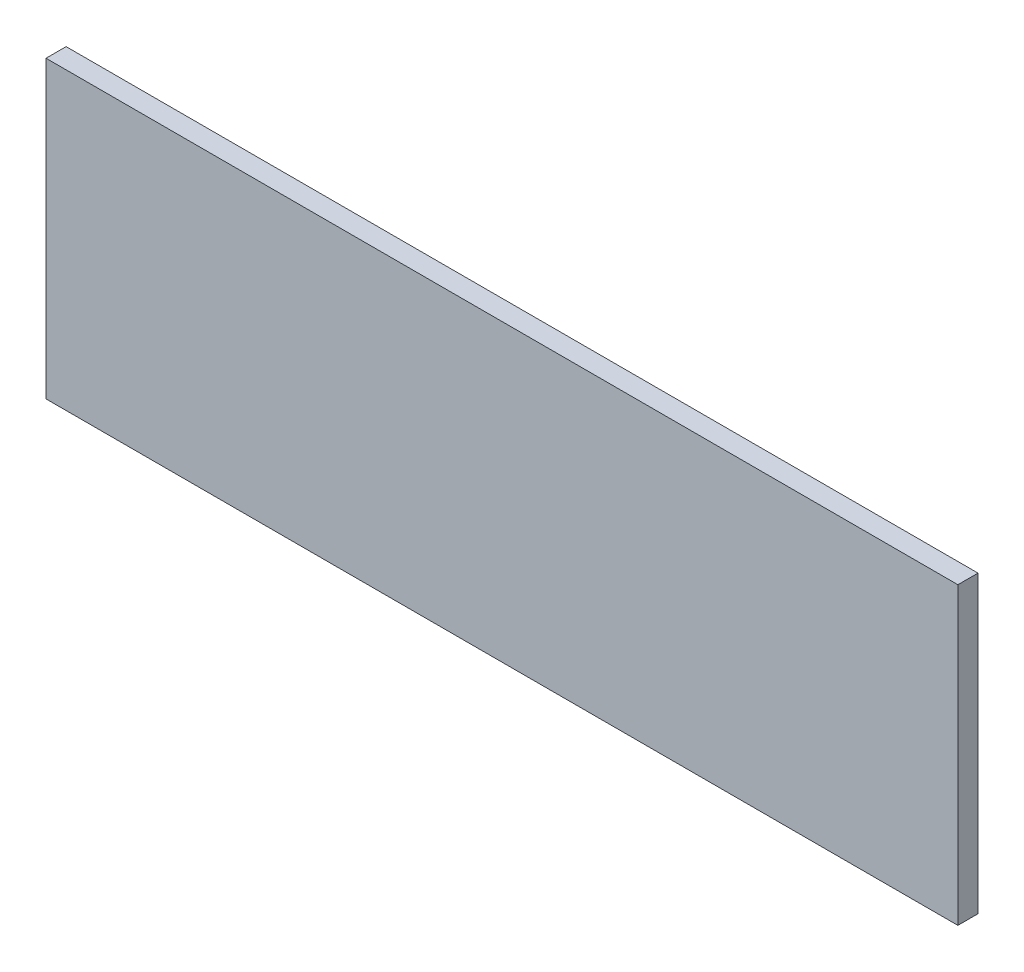
ISO-10303-21;
HEADER;
FILE_DESCRIPTION(('STEP AP214'),'2;1');
FILE_NAME('part.step','',(''),(''),'','','');
FILE_SCHEMA(('AUTOMOTIVE_DESIGN { 1 0 10303 214 1 1 1 1 }'));
ENDSEC;
DATA;
#1=APPLICATION_CONTEXT('core data for automotive mechanical design processes');
#2=APPLICATION_PROTOCOL_DEFINITION('international standard','automotive_design',2000,#1);
#3=PRODUCT_CONTEXT('',#1,'mechanical');
#4=PRODUCT('Part','Part','',(#3));
#5=PRODUCT_RELATED_PRODUCT_CATEGORY('part','',(#4));
#6=PRODUCT_DEFINITION_FORMATION('','',#4);
#7=PRODUCT_DEFINITION_CONTEXT('part definition',#1,'design');
#8=PRODUCT_DEFINITION('design','',#6,#7);
#9=PRODUCT_DEFINITION_SHAPE('','',#8);
#10=(LENGTH_UNIT() NAMED_UNIT(*) SI_UNIT(.MILLI.,.METRE.));
#11=(NAMED_UNIT(*) PLANE_ANGLE_UNIT() SI_UNIT($,.RADIAN.));
#12=(NAMED_UNIT(*) SI_UNIT($,.STERADIAN.) SOLID_ANGLE_UNIT());
#13=UNCERTAINTY_MEASURE_WITH_UNIT(LENGTH_MEASURE(1.E-05),#10,'distance_accuracy_value','');
#14=(GEOMETRIC_REPRESENTATION_CONTEXT(3) GLOBAL_UNCERTAINTY_ASSIGNED_CONTEXT((#13)) GLOBAL_UNIT_ASSIGNED_CONTEXT((#10,
#11,#12)) REPRESENTATION_CONTEXT('',''));
#15=CARTESIAN_POINT('',(0.,0.,0.));
#16=DIRECTION('',(0.,0.,1.));
#17=DIRECTION('',(1.,0.,0.));
#18=AXIS2_PLACEMENT_3D('',#15,#16,#17);
#19=CARTESIAN_POINT('',(52.6371308016878,-0.0100000000000031,-44.8481012658228));
#20=DIRECTION('',(1.,0.,0.));
#21=DIRECTION('',(0.,0.,-1.));
#22=AXIS2_PLACEMENT_3D('',#19,#20,#21);
#23=PLANE('',#22);
#24=DIRECTION('',(0.,0.,1.));
#25=VECTOR('',#24,1.);
#26=CARTESIAN_POINT('',(52.6371308016878,3.,0.));
#27=LINE('',#26,#25);
#28=CARTESIAN_POINT('',(52.6371308016878,3.,-47.8481012658228));
#29=VERTEX_POINT('',#28);
#30=CARTESIAN_POINT('',(52.6371308016878,3.,-44.8481012658228));
#31=VERTEX_POINT('',#30);
#32=EDGE_CURVE('E90',#29,#31,#27,.T.);
#33=ORIENTED_EDGE('',*,*,#32,.F.);
#34=DIRECTION('',(0.,1.,0.));
#35=VECTOR('',#34,1.);
#36=CARTESIAN_POINT('',(52.6371308016878,-0.0100000000000031,-47.8481012658228));
#37=LINE('',#36,#35);
#38=CARTESIAN_POINT('',(52.6371308016878,47.,-47.8481012658228));
#39=VERTEX_POINT('',#38);
#40=EDGE_CURVE('E77',#29,#39,#37,.T.);
#41=ORIENTED_EDGE('',*,*,#40,.T.);
#42=DIRECTION('',(0.,0.,-1.));
#43=VECTOR('',#42,1.);
#44=CARTESIAN_POINT('',(52.6371308016878,47.,0.));
#45=LINE('',#44,#43);
#46=CARTESIAN_POINT('',(52.6371308016878,47.,-44.8481012658228));
#47=VERTEX_POINT('',#46);
#48=EDGE_CURVE('E85',#47,#39,#45,.T.);
#49=ORIENTED_EDGE('',*,*,#48,.F.);
#50=DIRECTION('',(0.,1.,0.));
#51=VECTOR('',#50,1.);
#52=CARTESIAN_POINT('',(52.6371308016878,-0.0100000000000031,-44.8481012658228));
#53=LINE('',#52,#51);
#54=EDGE_CURVE('E49',#31,#47,#53,.T.);
#55=ORIENTED_EDGE('',*,*,#54,.F.);
#56=EDGE_LOOP('',(#33,#41,#49,#55));
#57=FACE_BOUND('',#56,.T.);
#58=ADVANCED_FACE('F32',(#57),#23,.T.);
#59=CARTESIAN_POINT('',(-83.3544303797469,-0.0100000000000031,-44.8481012658228));
#60=DIRECTION('',(-1.,0.,0.));
#61=DIRECTION('',(0.,0.,1.));
#62=AXIS2_PLACEMENT_3D('',#59,#60,#61);
#63=PLANE('',#62);
#64=DIRECTION('',(0.,0.,-1.));
#65=VECTOR('',#64,1.);
#66=CARTESIAN_POINT('',(-83.3544303797469,3.,0.));
#67=LINE('',#66,#65);
#68=CARTESIAN_POINT('',(-83.3544303797469,3.,-44.8481012658228));
#69=VERTEX_POINT('',#68);
#70=CARTESIAN_POINT('',(-83.3544303797469,3.,-47.8481012658228));
#71=VERTEX_POINT('',#70);
#72=EDGE_CURVE('E98',#69,#71,#67,.T.);
#73=ORIENTED_EDGE('',*,*,#72,.F.);
#74=DIRECTION('',(0.,1.,0.));
#75=VECTOR('',#74,1.);
#76=CARTESIAN_POINT('',(-83.3544303797469,-0.0100000000000031,-44.8481012658228));
#77=LINE('',#76,#75);
#78=CARTESIAN_POINT('',(-83.3544303797469,47.,-44.8481012658228));
#79=VERTEX_POINT('',#78);
#80=EDGE_CURVE('E88',#69,#79,#77,.T.);
#81=ORIENTED_EDGE('',*,*,#80,.T.);
#82=DIRECTION('',(0.,0.,1.));
#83=VECTOR('',#82,1.);
#84=CARTESIAN_POINT('',(-83.3544303797469,47.,0.));
#85=LINE('',#84,#83);
#86=CARTESIAN_POINT('',(-83.3544303797469,47.,-47.8481012658228));
#87=VERTEX_POINT('',#86);
#88=EDGE_CURVE('E87',#87,#79,#85,.T.);
#89=ORIENTED_EDGE('',*,*,#88,.F.);
#90=DIRECTION('',(0.,-1.,0.));
#91=VECTOR('',#90,1.);
#92=CARTESIAN_POINT('',(-83.3544303797469,50.,-47.8481012658228));
#93=LINE('',#92,#91);
#94=EDGE_CURVE('E36',#87,#71,#93,.T.);
#95=ORIENTED_EDGE('',*,*,#94,.T.);
#96=EDGE_LOOP('',(#73,#81,#89,#95));
#97=FACE_BOUND('',#96,.T.);
#98=ADVANCED_FACE('F106',(#97),#63,.T.);
#99=CARTESIAN_POINT('',(-98.3544303797468,50.,-47.8481012658228));
#100=DIRECTION('',(0.,0.,1.));
#101=DIRECTION('',(1.,0.,0.));
#102=AXIS2_PLACEMENT_3D('',#99,#100,#101);
#103=PLANE('',#102);
#104=ORIENTED_EDGE('',*,*,#40,.F.);
#105=DIRECTION('',(1.,0.,0.));
#106=VECTOR('',#105,1.);
#107=CARTESIAN_POINT('',(-98.3544303797468,3.,-47.8481012658228));
#108=LINE('',#107,#106);
#109=EDGE_CURVE('E41',#71,#29,#108,.T.);
#110=ORIENTED_EDGE('',*,*,#109,.F.);
#111=ORIENTED_EDGE('',*,*,#94,.F.);
#112=DIRECTION('',(-1.,0.,0.));
#113=VECTOR('',#112,1.);
#114=CARTESIAN_POINT('',(-98.3544303797468,47.,-47.8481012658228));
#115=LINE('',#114,#113);
#116=EDGE_CURVE('E73',#39,#87,#115,.T.);
#117=ORIENTED_EDGE('',*,*,#116,.F.);
#118=EDGE_LOOP('',(#104,#110,#111,#117));
#119=FACE_BOUND('',#118,.T.);
#120=ADVANCED_FACE('F75',(#119),#103,.F.);
#121=CARTESIAN_POINT('',(0.,47.,0.));
#122=DIRECTION('',(0.,1.,0.));
#123=DIRECTION('',(0.,0.,1.));
#124=AXIS2_PLACEMENT_3D('',#121,#122,#123);
#125=PLANE('',#124);
#126=DIRECTION('',(-1.,0.,0.));
#127=VECTOR('',#126,1.);
#128=CARTESIAN_POINT('',(-98.3544303797468,47.,-44.8481012658228));
#129=LINE('',#128,#127);
#130=EDGE_CURVE('E82',#47,#79,#129,.T.);
#131=ORIENTED_EDGE('',*,*,#130,.F.);
#132=ORIENTED_EDGE('',*,*,#48,.T.);
#133=ORIENTED_EDGE('',*,*,#116,.T.);
#134=ORIENTED_EDGE('',*,*,#88,.T.);
#135=EDGE_LOOP('',(#131,#132,#133,#134));
#136=FACE_BOUND('',#135,.T.);
#137=ADVANCED_FACE('F86',(#136),#125,.T.);
#138=CARTESIAN_POINT('',(0.,3.,0.));
#139=DIRECTION('',(0.,-1.,0.));
#140=DIRECTION('',(0.,0.,-1.));
#141=AXIS2_PLACEMENT_3D('',#138,#139,#140);
#142=PLANE('',#141);
#143=ORIENTED_EDGE('',*,*,#109,.T.);
#144=ORIENTED_EDGE('',*,*,#32,.T.);
#145=DIRECTION('',(-1.,0.,0.));
#146=VECTOR('',#145,1.);
#147=CARTESIAN_POINT('',(-98.3544303797468,3.,-44.8481012658228));
#148=LINE('',#147,#146);
#149=EDGE_CURVE('E11',#31,#69,#148,.T.);
#150=ORIENTED_EDGE('',*,*,#149,.T.);
#151=ORIENTED_EDGE('',*,*,#72,.T.);
#152=EDGE_LOOP('',(#143,#144,#150,#151));
#153=FACE_BOUND('',#152,.T.);
#154=ADVANCED_FACE('F102',(#153),#142,.T.);
#155=CARTESIAN_POINT('',(-98.3544303797468,47.,-44.8481012658228));
#156=DIRECTION('',(0.,0.,1.));
#157=DIRECTION('',(1.,0.,0.));
#158=AXIS2_PLACEMENT_3D('',#155,#156,#157);
#159=PLANE('',#158);
#160=ORIENTED_EDGE('',*,*,#149,.F.);
#161=ORIENTED_EDGE('',*,*,#54,.T.);
#162=ORIENTED_EDGE('',*,*,#130,.T.);
#163=ORIENTED_EDGE('',*,*,#80,.F.);
#164=EDGE_LOOP('',(#160,#161,#162,#163));
#165=FACE_BOUND('',#164,.T.);
#166=ADVANCED_FACE('F34',(#165),#159,.T.);
#167=CLOSED_SHELL('',(#58,#98,#120,#137,#154,#166));
#168=MANIFOLD_SOLID_BREP('B2',#167);
#169=ADVANCED_BREP_SHAPE_REPRESENTATION('',(#18,#168),#14);
#170=SHAPE_DEFINITION_REPRESENTATION(#9,#169);
ENDSEC;
END-ISO-10303-21;
